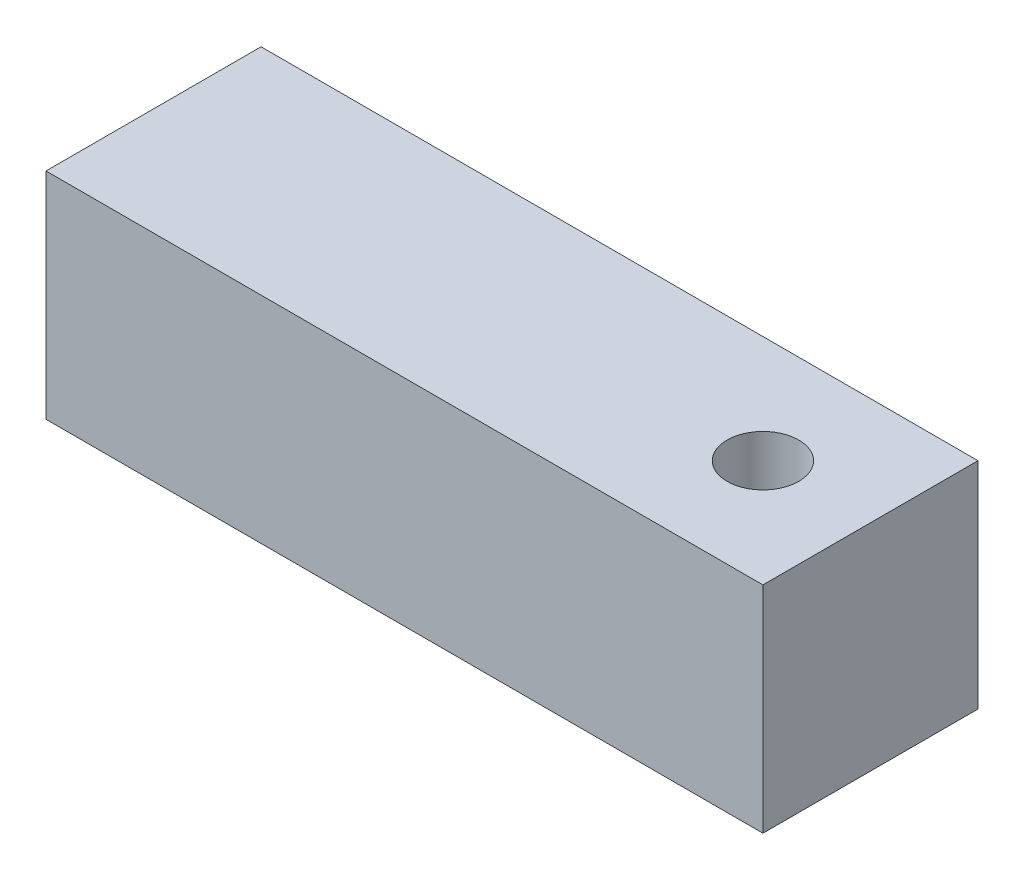
ISO-10303-21;
HEADER;
FILE_DESCRIPTION(('STEP AP214'),'2;1');
FILE_NAME('part.step','',(''),(''),'','','');
FILE_SCHEMA(('AUTOMOTIVE_DESIGN { 1 0 10303 214 1 1 1 1 }'));
ENDSEC;
DATA;
#1=APPLICATION_CONTEXT('core data for automotive mechanical design processes');
#2=APPLICATION_PROTOCOL_DEFINITION('international standard','automotive_design',2000,#1);
#3=PRODUCT_CONTEXT('',#1,'mechanical');
#4=PRODUCT('Part','Part','',(#3));
#5=PRODUCT_RELATED_PRODUCT_CATEGORY('part','',(#4));
#6=PRODUCT_DEFINITION_FORMATION('','',#4);
#7=PRODUCT_DEFINITION_CONTEXT('part definition',#1,'design');
#8=PRODUCT_DEFINITION('design','',#6,#7);
#9=PRODUCT_DEFINITION_SHAPE('','',#8);
#10=(LENGTH_UNIT() NAMED_UNIT(*) SI_UNIT(.MILLI.,.METRE.));
#11=(NAMED_UNIT(*) PLANE_ANGLE_UNIT() SI_UNIT($,.RADIAN.));
#12=(NAMED_UNIT(*) SI_UNIT($,.STERADIAN.) SOLID_ANGLE_UNIT());
#13=UNCERTAINTY_MEASURE_WITH_UNIT(LENGTH_MEASURE(1.E-05),#10,'distance_accuracy_value','');
#14=(GEOMETRIC_REPRESENTATION_CONTEXT(3) GLOBAL_UNCERTAINTY_ASSIGNED_CONTEXT((#13)) GLOBAL_UNIT_ASSIGNED_CONTEXT((#10,
#11,#12)) REPRESENTATION_CONTEXT('',''));
#15=CARTESIAN_POINT('',(0.,0.,0.));
#16=DIRECTION('',(0.,0.,1.));
#17=DIRECTION('',(1.,0.,0.));
#18=AXIS2_PLACEMENT_3D('',#15,#16,#17);
#19=CARTESIAN_POINT('',(0.,15.,0.));
#20=DIRECTION('',(0.,-1.,0.));
#21=DIRECTION('',(0.,0.,-1.));
#22=AXIS2_PLACEMENT_3D('',#19,#20,#21);
#23=PLANE('',#22);
#24=DIRECTION('',(0.,0.,1.));
#25=VECTOR('',#24,1.);
#26=CARTESIAN_POINT('',(0.,15.,0.));
#27=LINE('',#26,#25);
#28=CARTESIAN_POINT('',(0.,15.,-15.));
#29=VERTEX_POINT('',#28);
#30=CARTESIAN_POINT('',(0.,15.,0.));
#31=VERTEX_POINT('',#30);
#32=EDGE_CURVE('E98',#29,#31,#27,.T.);
#33=ORIENTED_EDGE('',*,*,#32,.T.);
#34=DIRECTION('',(1.,0.,0.));
#35=VECTOR('',#34,1.);
#36=CARTESIAN_POINT('',(0.,15.,0.));
#37=LINE('',#36,#35);
#38=CARTESIAN_POINT('',(50.,15.,0.));
#39=VERTEX_POINT('',#38);
#40=EDGE_CURVE('E93',#31,#39,#37,.T.);
#41=ORIENTED_EDGE('',*,*,#40,.T.);
#42=DIRECTION('',(0.,0.,-1.));
#43=VECTOR('',#42,1.);
#44=CARTESIAN_POINT('',(50.,15.,0.));
#45=LINE('',#44,#43);
#46=CARTESIAN_POINT('',(50.,15.,-15.));
#47=VERTEX_POINT('',#46);
#48=EDGE_CURVE('E96',#39,#47,#45,.T.);
#49=ORIENTED_EDGE('',*,*,#48,.T.);
#50=DIRECTION('',(-1.,0.,0.));
#51=VECTOR('',#50,1.);
#52=CARTESIAN_POINT('',(0.,15.,-15.));
#53=LINE('',#52,#51);
#54=EDGE_CURVE('E63',#47,#29,#53,.T.);
#55=ORIENTED_EDGE('',*,*,#54,.T.);
#56=EDGE_LOOP('',(#33,#41,#49,#55));
#57=FACE_BOUND('',#56,.T.);
#58=CARTESIAN_POINT('',(42.5,15.,-7.5));
#59=DIRECTION('',(0.,1.,0.));
#60=DIRECTION('',(0.,0.,1.));
#61=AXIS2_PLACEMENT_3D('',#58,#59,#60);
#62=CIRCLE('',#61,2.5);
#63=CARTESIAN_POINT('',(42.5,15.,-5.));
#64=VERTEX_POINT('',#63);
#65=EDGE_CURVE('E118',#64,#64,#62,.T.);
#66=ORIENTED_EDGE('',*,*,#65,.F.);
#67=EDGE_LOOP('',(#66));
#68=FACE_BOUND('',#67,.T.);
#69=ADVANCED_FACE('F45',(#57,#68),#23,.F.);
#70=CARTESIAN_POINT('',(0.,0.,0.));
#71=DIRECTION('',(0.,-1.,0.));
#72=DIRECTION('',(0.,0.,-1.));
#73=AXIS2_PLACEMENT_3D('',#70,#71,#72);
#74=PLANE('',#73);
#75=DIRECTION('',(0.,0.,1.));
#76=VECTOR('',#75,1.);
#77=CARTESIAN_POINT('',(0.,0.,0.));
#78=LINE('',#77,#76);
#79=CARTESIAN_POINT('',(0.,0.,-15.));
#80=VERTEX_POINT('',#79);
#81=CARTESIAN_POINT('',(0.,0.,0.));
#82=VERTEX_POINT('',#81);
#83=EDGE_CURVE('E114',#80,#82,#78,.T.);
#84=ORIENTED_EDGE('',*,*,#83,.F.);
#85=DIRECTION('',(-1.,0.,0.));
#86=VECTOR('',#85,1.);
#87=CARTESIAN_POINT('',(0.,0.,-15.));
#88=LINE('',#87,#86);
#89=CARTESIAN_POINT('',(50.,0.,-15.));
#90=VERTEX_POINT('',#89);
#91=EDGE_CURVE('E86',#90,#80,#88,.T.);
#92=ORIENTED_EDGE('',*,*,#91,.F.);
#93=DIRECTION('',(0.,0.,-1.));
#94=VECTOR('',#93,1.);
#95=CARTESIAN_POINT('',(50.,0.,0.));
#96=LINE('',#95,#94);
#97=CARTESIAN_POINT('',(50.,0.,0.));
#98=VERTEX_POINT('',#97);
#99=EDGE_CURVE('E80',#98,#90,#96,.T.);
#100=ORIENTED_EDGE('',*,*,#99,.F.);
#101=DIRECTION('',(1.,0.,0.));
#102=VECTOR('',#101,1.);
#103=CARTESIAN_POINT('',(0.,0.,0.));
#104=LINE('',#103,#102);
#105=EDGE_CURVE('E103',#82,#98,#104,.T.);
#106=ORIENTED_EDGE('',*,*,#105,.F.);
#107=EDGE_LOOP('',(#84,#92,#100,#106));
#108=FACE_BOUND('',#107,.T.);
#109=CARTESIAN_POINT('',(42.5,0.,-7.5));
#110=DIRECTION('',(0.,1.,0.));
#111=DIRECTION('',(0.,0.,1.));
#112=AXIS2_PLACEMENT_3D('',#109,#110,#111);
#113=CIRCLE('',#112,2.5);
#114=CARTESIAN_POINT('',(42.5,0.,-5.));
#115=VERTEX_POINT('',#114);
#116=EDGE_CURVE('E136',#115,#115,#113,.T.);
#117=ORIENTED_EDGE('',*,*,#116,.T.);
#118=EDGE_LOOP('',(#117));
#119=FACE_BOUND('',#118,.T.);
#120=ADVANCED_FACE('F131',(#108,#119),#74,.T.);
#121=CARTESIAN_POINT('',(0.,15.,0.));
#122=DIRECTION('',(1.,0.,0.));
#123=DIRECTION('',(0.,0.,-1.));
#124=AXIS2_PLACEMENT_3D('',#121,#122,#123);
#125=PLANE('',#124);
#126=ORIENTED_EDGE('',*,*,#83,.T.);
#127=DIRECTION('',(0.,-1.,0.));
#128=VECTOR('',#127,1.);
#129=CARTESIAN_POINT('',(0.,15.,0.));
#130=LINE('',#129,#128);
#131=EDGE_CURVE('E11',#31,#82,#130,.T.);
#132=ORIENTED_EDGE('',*,*,#131,.F.);
#133=ORIENTED_EDGE('',*,*,#32,.F.);
#134=DIRECTION('',(0.,-1.,0.));
#135=VECTOR('',#134,1.);
#136=CARTESIAN_POINT('',(0.,15.,-15.));
#137=LINE('',#136,#135);
#138=EDGE_CURVE('E110',#29,#80,#137,.T.);
#139=ORIENTED_EDGE('',*,*,#138,.T.);
#140=EDGE_LOOP('',(#126,#132,#133,#139));
#141=FACE_BOUND('',#140,.T.);
#142=ADVANCED_FACE('F47',(#141),#125,.F.);
#143=CARTESIAN_POINT('',(0.,15.,0.));
#144=DIRECTION('',(0.,0.,-1.));
#145=DIRECTION('',(-1.,0.,0.));
#146=AXIS2_PLACEMENT_3D('',#143,#144,#145);
#147=PLANE('',#146);
#148=ORIENTED_EDGE('',*,*,#105,.T.);
#149=DIRECTION('',(0.,-1.,0.));
#150=VECTOR('',#149,1.);
#151=CARTESIAN_POINT('',(50.,15.,0.));
#152=LINE('',#151,#150);
#153=EDGE_CURVE('E55',#39,#98,#152,.T.);
#154=ORIENTED_EDGE('',*,*,#153,.F.);
#155=ORIENTED_EDGE('',*,*,#40,.F.);
#156=ORIENTED_EDGE('',*,*,#131,.T.);
#157=EDGE_LOOP('',(#148,#154,#155,#156));
#158=FACE_BOUND('',#157,.T.);
#159=ADVANCED_FACE('F102',(#158),#147,.F.);
#160=CARTESIAN_POINT('',(50.,15.,0.));
#161=DIRECTION('',(-1.,0.,0.));
#162=DIRECTION('',(0.,0.,1.));
#163=AXIS2_PLACEMENT_3D('',#160,#161,#162);
#164=PLANE('',#163);
#165=ORIENTED_EDGE('',*,*,#99,.T.);
#166=DIRECTION('',(0.,-1.,0.));
#167=VECTOR('',#166,1.);
#168=CARTESIAN_POINT('',(50.,15.,-15.));
#169=LINE('',#168,#167);
#170=EDGE_CURVE('E105',#47,#90,#169,.T.);
#171=ORIENTED_EDGE('',*,*,#170,.F.);
#172=ORIENTED_EDGE('',*,*,#48,.F.);
#173=ORIENTED_EDGE('',*,*,#153,.T.);
#174=EDGE_LOOP('',(#165,#171,#172,#173));
#175=FACE_BOUND('',#174,.T.);
#176=ADVANCED_FACE('F106',(#175),#164,.F.);
#177=CARTESIAN_POINT('',(0.,15.,-15.));
#178=DIRECTION('',(0.,0.,1.));
#179=DIRECTION('',(1.,0.,0.));
#180=AXIS2_PLACEMENT_3D('',#177,#178,#179);
#181=PLANE('',#180);
#182=ORIENTED_EDGE('',*,*,#91,.T.);
#183=ORIENTED_EDGE('',*,*,#138,.F.);
#184=ORIENTED_EDGE('',*,*,#54,.F.);
#185=ORIENTED_EDGE('',*,*,#170,.T.);
#186=EDGE_LOOP('',(#182,#183,#184,#185));
#187=FACE_BOUND('',#186,.T.);
#188=ADVANCED_FACE('F128',(#187),#181,.F.);
#189=CARTESIAN_POINT('',(42.5,15.,-7.5));
#190=DIRECTION('',(0.,-1.,0.));
#191=DIRECTION('',(0.,0.,-1.));
#192=AXIS2_PLACEMENT_3D('',#189,#190,#191);
#193=CYLINDRICAL_SURFACE('',#192,2.5);
#194=ORIENTED_EDGE('',*,*,#65,.T.);
#195=EDGE_LOOP('',(#194));
#196=FACE_BOUND('',#195,.T.);
#197=ORIENTED_EDGE('',*,*,#116,.F.);
#198=EDGE_LOOP('',(#197));
#199=FACE_BOUND('',#198,.T.);
#200=ADVANCED_FACE('F144',(#196,#199),#193,.F.);
#201=CLOSED_SHELL('',(#69,#120,#142,#159,#176,#188,#200));
#202=MANIFOLD_SOLID_BREP('B2',#201);
#203=ADVANCED_BREP_SHAPE_REPRESENTATION('',(#18,#202),#14);
#204=SHAPE_DEFINITION_REPRESENTATION(#9,#203);
ENDSEC;
END-ISO-10303-21;
